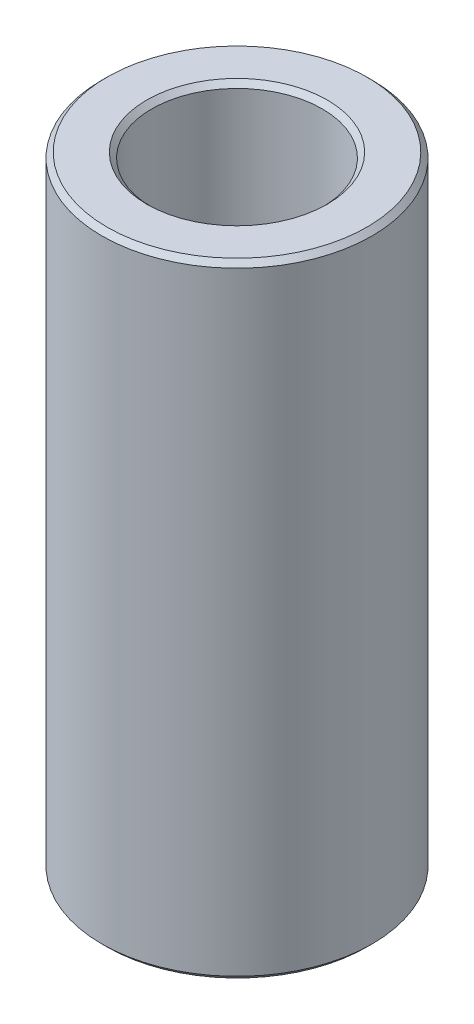
ISO-10303-21;
HEADER;
FILE_DESCRIPTION(('STEP AP214'),'2;1');
FILE_NAME('part.step','',(''),(''),'','','');
FILE_SCHEMA(('AUTOMOTIVE_DESIGN { 1 0 10303 214 1 1 1 1 }'));
ENDSEC;
DATA;
#1=APPLICATION_CONTEXT('core data for automotive mechanical design processes');
#2=APPLICATION_PROTOCOL_DEFINITION('international standard','automotive_design',2000,#1);
#3=PRODUCT_CONTEXT('',#1,'mechanical');
#4=PRODUCT('Part','Part','',(#3));
#5=PRODUCT_RELATED_PRODUCT_CATEGORY('part','',(#4));
#6=PRODUCT_DEFINITION_FORMATION('','',#4);
#7=PRODUCT_DEFINITION_CONTEXT('part definition',#1,'design');
#8=PRODUCT_DEFINITION('design','',#6,#7);
#9=PRODUCT_DEFINITION_SHAPE('','',#8);
#10=(LENGTH_UNIT() NAMED_UNIT(*) SI_UNIT(.MILLI.,.METRE.));
#11=(NAMED_UNIT(*) PLANE_ANGLE_UNIT() SI_UNIT($,.RADIAN.));
#12=(NAMED_UNIT(*) SI_UNIT($,.STERADIAN.) SOLID_ANGLE_UNIT());
#13=UNCERTAINTY_MEASURE_WITH_UNIT(LENGTH_MEASURE(1.E-05),#10,'distance_accuracy_value','');
#14=(GEOMETRIC_REPRESENTATION_CONTEXT(3) GLOBAL_UNCERTAINTY_ASSIGNED_CONTEXT((#13)) GLOBAL_UNIT_ASSIGNED_CONTEXT((#10,
#11,#12)) REPRESENTATION_CONTEXT('',''));
#15=CARTESIAN_POINT('',(0.,0.,0.));
#16=DIRECTION('',(0.,0.,1.));
#17=DIRECTION('',(1.,0.,0.));
#18=AXIS2_PLACEMENT_3D('',#15,#16,#17);
#19=CARTESIAN_POINT('',(0.,253.867022828045,0.));
#20=DIRECTION('',(0.,-1.,0.));
#21=DIRECTION('',(0.,0.,-1.));
#22=AXIS2_PLACEMENT_3D('',#19,#20,#21);
#23=CYLINDRICAL_SURFACE('',#22,55.);
#24=CARTESIAN_POINT('',(0.,2.07378678196435,0.));
#25=DIRECTION('',(0.,1.,0.));
#26=DIRECTION('',(0.,0.,1.));
#27=AXIS2_PLACEMENT_3D('',#24,#25,#26);
#28=CIRCLE('',#27,55.);
#29=CARTESIAN_POINT('',(0.,2.07378678196435,55.));
#30=VERTEX_POINT('',#29);
#31=EDGE_CURVE('E10',#30,#30,#28,.T.);
#32=ORIENTED_EDGE('',*,*,#31,.T.);
#33=EDGE_LOOP('',(#32));
#34=FACE_BOUND('',#33,.T.);
#35=CARTESIAN_POINT('',(0.,251.793236046081,0.));
#36=DIRECTION('',(0.,1.,0.));
#37=DIRECTION('',(0.,0.,1.));
#38=AXIS2_PLACEMENT_3D('',#35,#36,#37);
#39=CIRCLE('',#38,55.);
#40=CARTESIAN_POINT('',(0.,251.793236046081,55.));
#41=VERTEX_POINT('',#40);
#42=EDGE_CURVE('E50',#41,#41,#39,.F.);
#43=ORIENTED_EDGE('',*,*,#42,.T.);
#44=EDGE_LOOP('',(#43));
#45=FACE_BOUND('',#44,.T.);
#46=ADVANCED_FACE('F39',(#34,#45),#23,.T.);
#47=CARTESIAN_POINT('',(0.,253.867022828045,0.));
#48=DIRECTION('',(0.,1.,0.));
#49=DIRECTION('',(0.,0.,1.));
#50=AXIS2_PLACEMENT_3D('',#47,#48,#49);
#51=PLANE('',#50);
#52=CARTESIAN_POINT('',(0.,253.867022828045,0.));
#53=DIRECTION('',(0.,1.,0.));
#54=DIRECTION('',(0.,0.,1.));
#55=AXIS2_PLACEMENT_3D('',#52,#53,#54);
#56=CIRCLE('',#55,36.7710368183895);
#57=CARTESIAN_POINT('',(0.,253.867022828045,36.7710368183895));
#58=VERTEX_POINT('',#57);
#59=EDGE_CURVE('E58',#58,#58,#56,.F.);
#60=ORIENTED_EDGE('',*,*,#59,.T.);
#61=EDGE_LOOP('',(#60));
#62=FACE_BOUND('',#61,.T.);
#63=CARTESIAN_POINT('',(0.,253.867022828045,0.));
#64=DIRECTION('',(0.,1.,0.));
#65=DIRECTION('',(0.,0.,1.));
#66=AXIS2_PLACEMENT_3D('',#63,#64,#65);
#67=CIRCLE('',#66,52.9262132180356);
#68=CARTESIAN_POINT('',(0.,253.867022828045,52.9262132180356));
#69=VERTEX_POINT('',#68);
#70=EDGE_CURVE('E61',#69,#69,#67,.T.);
#71=ORIENTED_EDGE('',*,*,#70,.T.);
#72=EDGE_LOOP('',(#71));
#73=FACE_BOUND('',#72,.T.);
#74=ADVANCED_FACE('F88',(#62,#73),#51,.T.);
#75=CARTESIAN_POINT('',(0.,0.,0.));
#76=DIRECTION('',(0.,1.,0.));
#77=DIRECTION('',(0.,0.,1.));
#78=AXIS2_PLACEMENT_3D('',#75,#76,#77);
#79=PLANE('',#78);
#80=CARTESIAN_POINT('',(0.,0.,0.));
#81=DIRECTION('',(0.,1.,0.));
#82=DIRECTION('',(0.,0.,1.));
#83=AXIS2_PLACEMENT_3D('',#80,#81,#82);
#84=CIRCLE('',#83,36.7710368183895);
#85=CARTESIAN_POINT('',(0.,0.,36.7710368183895));
#86=VERTEX_POINT('',#85);
#87=EDGE_CURVE('E51',#86,#86,#84,.T.);
#88=ORIENTED_EDGE('',*,*,#87,.T.);
#89=EDGE_LOOP('',(#88));
#90=FACE_BOUND('',#89,.T.);
#91=CARTESIAN_POINT('',(0.,0.,0.));
#92=DIRECTION('',(0.,1.,0.));
#93=DIRECTION('',(0.,0.,1.));
#94=AXIS2_PLACEMENT_3D('',#91,#92,#93);
#95=CIRCLE('',#94,52.9262132180356);
#96=CARTESIAN_POINT('',(0.,0.,52.9262132180356));
#97=VERTEX_POINT('',#96);
#98=EDGE_CURVE('E54',#97,#97,#95,.F.);
#99=ORIENTED_EDGE('',*,*,#98,.T.);
#100=EDGE_LOOP('',(#99));
#101=FACE_BOUND('',#100,.T.);
#102=ADVANCED_FACE('F83',(#90,#101),#79,.F.);
#103=CARTESIAN_POINT('',(0.,253.867022828045,0.));
#104=DIRECTION('',(0.,-1.,0.));
#105=DIRECTION('',(0.,0.,-1.));
#106=AXIS2_PLACEMENT_3D('',#103,#104,#105);
#107=CYLINDRICAL_SURFACE('',#106,34.6972500364251);
#108=CARTESIAN_POINT('',(0.,251.793236046081,0.));
#109=DIRECTION('',(0.,1.,0.));
#110=DIRECTION('',(0.,0.,1.));
#111=AXIS2_PLACEMENT_3D('',#108,#109,#110);
#112=CIRCLE('',#111,34.6972500364251);
#113=CARTESIAN_POINT('',(0.,251.793236046081,34.6972500364251));
#114=VERTEX_POINT('',#113);
#115=EDGE_CURVE('E67',#114,#114,#112,.T.);
#116=ORIENTED_EDGE('',*,*,#115,.T.);
#117=EDGE_LOOP('',(#116));
#118=FACE_BOUND('',#117,.T.);
#119=CARTESIAN_POINT('',(0.,2.0737867819644,0.));
#120=DIRECTION('',(0.,1.,0.));
#121=DIRECTION('',(0.,0.,1.));
#122=AXIS2_PLACEMENT_3D('',#119,#120,#121);
#123=CIRCLE('',#122,34.6972500364251);
#124=CARTESIAN_POINT('',(0.,2.0737867819644,34.6972500364251));
#125=VERTEX_POINT('',#124);
#126=EDGE_CURVE('E69',#125,#125,#123,.F.);
#127=ORIENTED_EDGE('',*,*,#126,.T.);
#128=EDGE_LOOP('',(#127));
#129=FACE_BOUND('',#128,.T.);
#130=ADVANCED_FACE('F71',(#118,#129),#107,.F.);
#131=CARTESIAN_POINT('',(0.,251.793236046081,0.));
#132=DIRECTION('',(0.,1.,0.));
#133=DIRECTION('',(0.,0.,1.));
#134=AXIS2_PLACEMENT_3D('',#131,#132,#133);
#135=CONICAL_SURFACE('',#134,34.6972500364251,0.78539816339745);
#136=ORIENTED_EDGE('',*,*,#59,.F.);
#137=EDGE_LOOP('',(#136));
#138=FACE_BOUND('',#137,.T.);
#139=ORIENTED_EDGE('',*,*,#115,.F.);
#140=EDGE_LOOP('',(#139));
#141=FACE_BOUND('',#140,.T.);
#142=ADVANCED_FACE('F77',(#138,#141),#135,.F.);
#143=CARTESIAN_POINT('',(0.,0.,0.));
#144=DIRECTION('',(0.,-1.,0.));
#145=DIRECTION('',(0.,0.,-1.));
#146=AXIS2_PLACEMENT_3D('',#143,#144,#145);
#147=CONICAL_SURFACE('',#146,36.7710368183895,0.785398163397437);
#148=ORIENTED_EDGE('',*,*,#126,.F.);
#149=EDGE_LOOP('',(#148));
#150=FACE_BOUND('',#149,.T.);
#151=ORIENTED_EDGE('',*,*,#87,.F.);
#152=EDGE_LOOP('',(#151));
#153=FACE_BOUND('',#152,.T.);
#154=ADVANCED_FACE('F73',(#150,#153),#147,.F.);
#155=CARTESIAN_POINT('',(0.,2.07378678196435,0.));
#156=DIRECTION('',(0.,1.,0.));
#157=DIRECTION('',(0.,0.,1.));
#158=AXIS2_PLACEMENT_3D('',#155,#156,#157);
#159=CONICAL_SURFACE('',#158,55.,0.785398163397463);
#160=ORIENTED_EDGE('',*,*,#98,.F.);
#161=EDGE_LOOP('',(#160));
#162=FACE_BOUND('',#161,.T.);
#163=ORIENTED_EDGE('',*,*,#31,.F.);
#164=EDGE_LOOP('',(#163));
#165=FACE_BOUND('',#164,.T.);
#166=ADVANCED_FACE('F76',(#162,#165),#159,.T.);
#167=CARTESIAN_POINT('',(0.,253.867022828045,0.));
#168=DIRECTION('',(0.,-1.,0.));
#169=DIRECTION('',(0.,0.,-1.));
#170=AXIS2_PLACEMENT_3D('',#167,#168,#169);
#171=CONICAL_SURFACE('',#170,52.9262132180356,0.78539816339745);
#172=ORIENTED_EDGE('',*,*,#42,.F.);
#173=EDGE_LOOP('',(#172));
#174=FACE_BOUND('',#173,.T.);
#175=ORIENTED_EDGE('',*,*,#70,.F.);
#176=EDGE_LOOP('',(#175));
#177=FACE_BOUND('',#176,.T.);
#178=ADVANCED_FACE('F45',(#174,#177),#171,.T.);
#179=CLOSED_SHELL('',(#46,#74,#102,#130,#142,#154,#166,#178));
#180=MANIFOLD_SOLID_BREP('B2',#179);
#181=ADVANCED_BREP_SHAPE_REPRESENTATION('',(#18,#180),#14);
#182=SHAPE_DEFINITION_REPRESENTATION(#9,#181);
ENDSEC;
END-ISO-10303-21;
